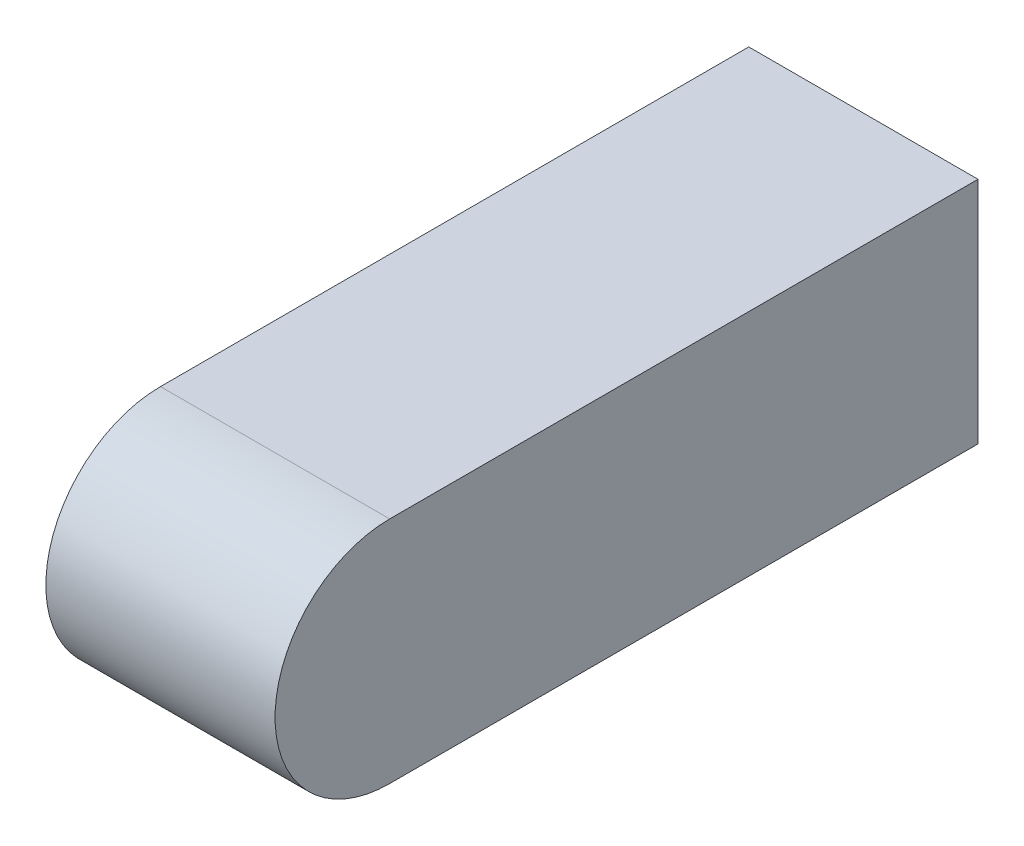
ISO-10303-21;
HEADER;
FILE_DESCRIPTION(('STEP AP214'),'2;1');
FILE_NAME('part.step','',(''),(''),'','','');
FILE_SCHEMA(('AUTOMOTIVE_DESIGN { 1 0 10303 214 1 1 1 1 }'));
ENDSEC;
DATA;
#1=APPLICATION_CONTEXT('core data for automotive mechanical design processes');
#2=APPLICATION_PROTOCOL_DEFINITION('international standard','automotive_design',2000,#1);
#3=PRODUCT_CONTEXT('',#1,'mechanical');
#4=PRODUCT('Part','Part','',(#3));
#5=PRODUCT_RELATED_PRODUCT_CATEGORY('part','',(#4));
#6=PRODUCT_DEFINITION_FORMATION('','',#4);
#7=PRODUCT_DEFINITION_CONTEXT('part definition',#1,'design');
#8=PRODUCT_DEFINITION('design','',#6,#7);
#9=PRODUCT_DEFINITION_SHAPE('','',#8);
#10=(LENGTH_UNIT() NAMED_UNIT(*) SI_UNIT(.MILLI.,.METRE.));
#11=(NAMED_UNIT(*) PLANE_ANGLE_UNIT() SI_UNIT($,.RADIAN.));
#12=(NAMED_UNIT(*) SI_UNIT($,.STERADIAN.) SOLID_ANGLE_UNIT());
#13=UNCERTAINTY_MEASURE_WITH_UNIT(LENGTH_MEASURE(1.E-05),#10,'distance_accuracy_value','');
#14=(GEOMETRIC_REPRESENTATION_CONTEXT(3) GLOBAL_UNCERTAINTY_ASSIGNED_CONTEXT((#13)) GLOBAL_UNIT_ASSIGNED_CONTEXT((#10,
#11,#12)) REPRESENTATION_CONTEXT('',''));
#15=CARTESIAN_POINT('',(0.,0.,0.));
#16=DIRECTION('',(0.,0.,1.));
#17=DIRECTION('',(1.,0.,0.));
#18=AXIS2_PLACEMENT_3D('',#15,#16,#17);
#19=CARTESIAN_POINT('',(-22.5,22.5,138.));
#20=DIRECTION('',(1.,0.,0.));
#21=DIRECTION('',(0.,1.,0.));
#22=AXIS2_PLACEMENT_3D('',#19,#20,#21);
#23=PLANE('',#22);
#24=DIRECTION('',(0.,0.,-1.));
#25=VECTOR('',#24,1.);
#26=CARTESIAN_POINT('',(-22.5,-22.5,138.));
#27=LINE('',#26,#25);
#28=CARTESIAN_POINT('',(-22.5,-22.5,115.5));
#29=VERTEX_POINT('',#28);
#30=CARTESIAN_POINT('',(-22.5,-22.5,0.));
#31=VERTEX_POINT('',#30);
#32=EDGE_CURVE('E12',#29,#31,#27,.T.);
#33=ORIENTED_EDGE('',*,*,#32,.F.);
#34=CARTESIAN_POINT('',(-22.5,0.,115.5));
#35=DIRECTION('',(1.,0.,0.));
#36=DIRECTION('',(0.,0.,-1.));
#37=AXIS2_PLACEMENT_3D('',#34,#35,#36);
#38=CIRCLE('',#37,22.5);
#39=CARTESIAN_POINT('',(-22.5,22.5,115.5));
#40=VERTEX_POINT('',#39);
#41=EDGE_CURVE('E121',#40,#29,#38,.T.);
#42=ORIENTED_EDGE('',*,*,#41,.F.);
#43=DIRECTION('',(0.,0.,-1.));
#44=VECTOR('',#43,1.);
#45=CARTESIAN_POINT('',(-22.5,22.5,138.));
#46=LINE('',#45,#44);
#47=CARTESIAN_POINT('',(-22.5,22.5,0.));
#48=VERTEX_POINT('',#47);
#49=EDGE_CURVE('E89',#40,#48,#46,.T.);
#50=ORIENTED_EDGE('',*,*,#49,.T.);
#51=DIRECTION('',(0.,-1.,0.));
#52=VECTOR('',#51,1.);
#53=CARTESIAN_POINT('',(-22.5,22.5,0.));
#54=LINE('',#53,#52);
#55=EDGE_CURVE('E141',#48,#31,#54,.T.);
#56=ORIENTED_EDGE('',*,*,#55,.T.);
#57=EDGE_LOOP('',(#33,#42,#50,#56));
#58=FACE_BOUND('',#57,.T.);
#59=ADVANCED_FACE('F75',(#58),#23,.F.);
#60=CARTESIAN_POINT('',(22.5,22.5,138.));
#61=DIRECTION('',(-1.,0.,0.));
#62=DIRECTION('',(0.,-1.,0.));
#63=AXIS2_PLACEMENT_3D('',#60,#61,#62);
#64=PLANE('',#63);
#65=CARTESIAN_POINT('',(22.5,0.,115.5));
#66=DIRECTION('',(1.,0.,0.));
#67=DIRECTION('',(0.,0.,-1.));
#68=AXIS2_PLACEMENT_3D('',#65,#66,#67);
#69=CIRCLE('',#68,22.5);
#70=CARTESIAN_POINT('',(22.5,22.5,115.5));
#71=VERTEX_POINT('',#70);
#72=CARTESIAN_POINT('',(22.5,-22.5,115.5));
#73=VERTEX_POINT('',#72);
#74=EDGE_CURVE('E115',#71,#73,#69,.T.);
#75=ORIENTED_EDGE('',*,*,#74,.T.);
#76=DIRECTION('',(0.,0.,-1.));
#77=VECTOR('',#76,1.);
#78=CARTESIAN_POINT('',(22.5,-22.5,138.));
#79=LINE('',#78,#77);
#80=CARTESIAN_POINT('',(22.5,-22.5,0.));
#81=VERTEX_POINT('',#80);
#82=EDGE_CURVE('E82',#73,#81,#79,.T.);
#83=ORIENTED_EDGE('',*,*,#82,.T.);
#84=DIRECTION('',(0.,1.,0.));
#85=VECTOR('',#84,1.);
#86=CARTESIAN_POINT('',(22.5,22.5,0.));
#87=LINE('',#86,#85);
#88=CARTESIAN_POINT('',(22.5,22.5,0.));
#89=VERTEX_POINT('',#88);
#90=EDGE_CURVE('E138',#81,#89,#87,.T.);
#91=ORIENTED_EDGE('',*,*,#90,.T.);
#92=DIRECTION('',(0.,0.,-1.));
#93=VECTOR('',#92,1.);
#94=CARTESIAN_POINT('',(22.5,22.5,138.));
#95=LINE('',#94,#93);
#96=EDGE_CURVE('E96',#71,#89,#95,.T.);
#97=ORIENTED_EDGE('',*,*,#96,.F.);
#98=EDGE_LOOP('',(#75,#83,#91,#97));
#99=FACE_BOUND('',#98,.T.);
#100=ADVANCED_FACE('F117',(#99),#64,.F.);
#101=CARTESIAN_POINT('',(22.5,-22.5,138.));
#102=DIRECTION('',(0.,1.,0.));
#103=DIRECTION('',(-1.,0.,0.));
#104=AXIS2_PLACEMENT_3D('',#101,#102,#103);
#105=PLANE('',#104);
#106=DIRECTION('',(1.,0.,0.));
#107=VECTOR('',#106,1.);
#108=CARTESIAN_POINT('',(-22.5,-22.5,115.5));
#109=LINE('',#108,#107);
#110=EDGE_CURVE('E122',#29,#73,#109,.T.);
#111=ORIENTED_EDGE('',*,*,#110,.F.);
#112=ORIENTED_EDGE('',*,*,#32,.T.);
#113=DIRECTION('',(1.,0.,0.));
#114=VECTOR('',#113,1.);
#115=CARTESIAN_POINT('',(22.5,-22.5,0.));
#116=LINE('',#115,#114);
#117=EDGE_CURVE('E131',#31,#81,#116,.T.);
#118=ORIENTED_EDGE('',*,*,#117,.T.);
#119=ORIENTED_EDGE('',*,*,#82,.F.);
#120=EDGE_LOOP('',(#111,#112,#118,#119));
#121=FACE_BOUND('',#120,.T.);
#122=ADVANCED_FACE('F129',(#121),#105,.F.);
#123=CARTESIAN_POINT('',(22.5,22.5,138.));
#124=DIRECTION('',(0.,-1.,0.));
#125=DIRECTION('',(1.,0.,0.));
#126=AXIS2_PLACEMENT_3D('',#123,#124,#125);
#127=PLANE('',#126);
#128=ORIENTED_EDGE('',*,*,#49,.F.);
#129=DIRECTION('',(1.,0.,0.));
#130=VECTOR('',#129,1.);
#131=CARTESIAN_POINT('',(-22.5,22.5,115.5));
#132=LINE('',#131,#130);
#133=EDGE_CURVE('E143',#40,#71,#132,.T.);
#134=ORIENTED_EDGE('',*,*,#133,.T.);
#135=ORIENTED_EDGE('',*,*,#96,.T.);
#136=DIRECTION('',(-1.,0.,0.));
#137=VECTOR('',#136,1.);
#138=CARTESIAN_POINT('',(22.5,22.5,0.));
#139=LINE('',#138,#137);
#140=EDGE_CURVE('E136',#89,#48,#139,.T.);
#141=ORIENTED_EDGE('',*,*,#140,.T.);
#142=EDGE_LOOP('',(#128,#134,#135,#141));
#143=FACE_BOUND('',#142,.T.);
#144=ADVANCED_FACE('F145',(#143),#127,.F.);
#145=CARTESIAN_POINT('',(0.,0.,0.));
#146=DIRECTION('',(0.,0.,-1.));
#147=DIRECTION('',(-1.,0.,0.));
#148=AXIS2_PLACEMENT_3D('',#145,#146,#147);
#149=PLANE('',#148);
#150=ORIENTED_EDGE('',*,*,#55,.F.);
#151=ORIENTED_EDGE('',*,*,#140,.F.);
#152=ORIENTED_EDGE('',*,*,#90,.F.);
#153=ORIENTED_EDGE('',*,*,#117,.F.);
#154=EDGE_LOOP('',(#150,#151,#152,#153));
#155=FACE_BOUND('',#154,.T.);
#156=ADVANCED_FACE('F148',(#155),#149,.T.);
#157=CARTESIAN_POINT('',(-22.5,0.,115.5));
#158=DIRECTION('',(1.,0.,0.));
#159=DIRECTION('',(0.,0.,-1.));
#160=AXIS2_PLACEMENT_3D('',#157,#158,#159);
#161=CYLINDRICAL_SURFACE('',#160,22.5);
#162=ORIENTED_EDGE('',*,*,#133,.F.);
#163=ORIENTED_EDGE('',*,*,#41,.T.);
#164=ORIENTED_EDGE('',*,*,#110,.T.);
#165=ORIENTED_EDGE('',*,*,#74,.F.);
#166=EDGE_LOOP('',(#162,#163,#164,#165));
#167=FACE_BOUND('',#166,.T.);
#168=ADVANCED_FACE('F125',(#167),#161,.T.);
#169=CLOSED_SHELL('',(#59,#100,#122,#144,#156,#168));
#170=MANIFOLD_SOLID_BREP('B2',#169);
#171=ADVANCED_BREP_SHAPE_REPRESENTATION('',(#18,#170),#14);
#172=SHAPE_DEFINITION_REPRESENTATION(#9,#171);
ENDSEC;
END-ISO-10303-21;
